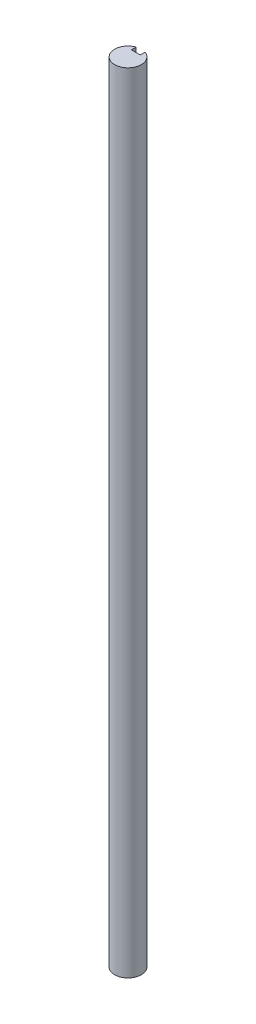
ISO-10303-21;
HEADER;
FILE_DESCRIPTION(('STEP AP214'),'2;1');
FILE_NAME('part.step','',(''),(''),'','','');
FILE_SCHEMA(('AUTOMOTIVE_DESIGN { 1 0 10303 214 1 1 1 1 }'));
ENDSEC;
DATA;
#1=APPLICATION_CONTEXT('core data for automotive mechanical design processes');
#2=APPLICATION_PROTOCOL_DEFINITION('international standard','automotive_design',2000,#1);
#3=PRODUCT_CONTEXT('',#1,'mechanical');
#4=PRODUCT('Part','Part','',(#3));
#5=PRODUCT_RELATED_PRODUCT_CATEGORY('part','',(#4));
#6=PRODUCT_DEFINITION_FORMATION('','',#4);
#7=PRODUCT_DEFINITION_CONTEXT('part definition',#1,'design');
#8=PRODUCT_DEFINITION('design','',#6,#7);
#9=PRODUCT_DEFINITION_SHAPE('','',#8);
#10=(LENGTH_UNIT() NAMED_UNIT(*) SI_UNIT(.MILLI.,.METRE.));
#11=(NAMED_UNIT(*) PLANE_ANGLE_UNIT() SI_UNIT($,.RADIAN.));
#12=(NAMED_UNIT(*) SI_UNIT($,.STERADIAN.) SOLID_ANGLE_UNIT());
#13=UNCERTAINTY_MEASURE_WITH_UNIT(LENGTH_MEASURE(1.E-05),#10,'distance_accuracy_value','');
#14=(GEOMETRIC_REPRESENTATION_CONTEXT(3) GLOBAL_UNCERTAINTY_ASSIGNED_CONTEXT((#13)) GLOBAL_UNIT_ASSIGNED_CONTEXT((#10,
#11,#12)) REPRESENTATION_CONTEXT('',''));
#15=CARTESIAN_POINT('',(0.,0.,0.));
#16=DIRECTION('',(0.,0.,1.));
#17=DIRECTION('',(1.,0.,0.));
#18=AXIS2_PLACEMENT_3D('',#15,#16,#17);
#19=CARTESIAN_POINT('',(0.,-100.,0.));
#20=DIRECTION('',(0.,1.,0.));
#21=DIRECTION('',(0.,0.,-1.));
#22=AXIS2_PLACEMENT_3D('',#19,#20,#21);
#23=PLANE('',#22);
#24=DIRECTION('',(0.,0.,-1.));
#25=VECTOR('',#24,1.);
#26=CARTESIAN_POINT('',(2.,-100.,0.));
#27=LINE('',#26,#25);
#28=CARTESIAN_POINT('',(2.,-100.,-1.));
#29=VERTEX_POINT('',#28);
#30=CARTESIAN_POINT('',(2.,-100.,-5.65685424949238));
#31=VERTEX_POINT('',#30);
#32=EDGE_CURVE('E135',#29,#31,#27,.T.);
#33=ORIENTED_EDGE('',*,*,#32,.T.);
#34=CARTESIAN_POINT('',(0.,-100.,0.));
#35=DIRECTION('',(0.,-1.,0.));
#36=DIRECTION('',(0.,0.,-1.));
#37=AXIS2_PLACEMENT_3D('',#34,#35,#36);
#38=CIRCLE('',#37,6.);
#39=CARTESIAN_POINT('',(-2.,-100.,-5.65685424949238));
#40=VERTEX_POINT('',#39);
#41=EDGE_CURVE('E182',#31,#40,#38,.T.);
#42=ORIENTED_EDGE('',*,*,#41,.T.);
#43=DIRECTION('',(0.,0.,1.));
#44=VECTOR('',#43,1.);
#45=CARTESIAN_POINT('',(-2.,-100.,0.));
#46=LINE('',#45,#44);
#47=CARTESIAN_POINT('',(-2.,-100.,-0.999999999999999));
#48=VERTEX_POINT('',#47);
#49=EDGE_CURVE('E185',#40,#48,#46,.T.);
#50=ORIENTED_EDGE('',*,*,#49,.T.);
#51=DIRECTION('',(-1.,0.,0.));
#52=VECTOR('',#51,1.);
#53=CARTESIAN_POINT('',(0.,-100.,-1.));
#54=LINE('',#53,#52);
#55=EDGE_CURVE('E130',#29,#48,#54,.T.);
#56=ORIENTED_EDGE('',*,*,#55,.F.);
#57=EDGE_LOOP('',(#33,#42,#50,#56));
#58=FACE_BOUND('',#57,.T.);
#59=ADVANCED_FACE('F37',(#58),#23,.F.);
#60=CARTESIAN_POINT('',(0.,-100.,0.));
#61=DIRECTION('',(0.,1.,0.));
#62=DIRECTION('',(0.,0.,-1.));
#63=AXIS2_PLACEMENT_3D('',#60,#61,#62);
#64=CYLINDRICAL_SURFACE('',#63,6.);
#65=CARTESIAN_POINT('',(0.,-80.,0.));
#66=DIRECTION('',(0.,-1.,0.));
#67=DIRECTION('',(0.,0.,-1.));
#68=AXIS2_PLACEMENT_3D('',#65,#66,#67);
#69=CIRCLE('',#68,6.);
#70=CARTESIAN_POINT('',(2.,-80.,-5.65685424949238));
#71=VERTEX_POINT('',#70);
#72=CARTESIAN_POINT('',(-2.,-80.,-5.65685424949238));
#73=VERTEX_POINT('',#72);
#74=EDGE_CURVE('E189',#71,#73,#69,.F.);
#75=ORIENTED_EDGE('',*,*,#74,.T.);
#76=DIRECTION('',(0.,1.,0.));
#77=VECTOR('',#76,1.);
#78=CARTESIAN_POINT('',(-2.,-100.,-5.65685424949238));
#79=LINE('',#78,#77);
#80=EDGE_CURVE('E174',#40,#73,#79,.T.);
#81=ORIENTED_EDGE('',*,*,#80,.F.);
#82=ORIENTED_EDGE('',*,*,#41,.F.);
#83=DIRECTION('',(0.,1.,0.));
#84=VECTOR('',#83,1.);
#85=CARTESIAN_POINT('',(2.,-100.,-5.65685424949238));
#86=LINE('',#85,#84);
#87=EDGE_CURVE('E177',#71,#31,#86,.F.);
#88=ORIENTED_EDGE('',*,*,#87,.F.);
#89=EDGE_LOOP('',(#75,#81,#82,#88));
#90=FACE_BOUND('',#89,.T.);
#91=CARTESIAN_POINT('',(0.,204.,0.));
#92=DIRECTION('',(0.,1.,0.));
#93=DIRECTION('',(0.,0.,1.));
#94=AXIS2_PLACEMENT_3D('',#91,#92,#93);
#95=CIRCLE('',#94,6.);
#96=CARTESIAN_POINT('',(-2.,204.,-5.65685424949238));
#97=VERTEX_POINT('',#96);
#98=CARTESIAN_POINT('',(2.,204.,-5.65685424949238));
#99=VERTEX_POINT('',#98);
#100=EDGE_CURVE('E11',#97,#99,#95,.F.);
#101=ORIENTED_EDGE('',*,*,#100,.T.);
#102=DIRECTION('',(0.,1.,0.));
#103=VECTOR('',#102,1.);
#104=CARTESIAN_POINT('',(2.,-100.,-5.65685424949238));
#105=LINE('',#104,#103);
#106=CARTESIAN_POINT('',(2.,254.,-5.65685424949238));
#107=VERTEX_POINT('',#106);
#108=EDGE_CURVE('E157',#107,#99,#105,.F.);
#109=ORIENTED_EDGE('',*,*,#108,.F.);
#110=CARTESIAN_POINT('',(0.,254.,0.));
#111=DIRECTION('',(0.,-1.,0.));
#112=DIRECTION('',(0.,0.,-1.));
#113=AXIS2_PLACEMENT_3D('',#110,#111,#112);
#114=CIRCLE('',#113,6.);
#115=CARTESIAN_POINT('',(-2.,254.,-5.65685424949238));
#116=VERTEX_POINT('',#115);
#117=EDGE_CURVE('E179',#107,#116,#114,.T.);
#118=ORIENTED_EDGE('',*,*,#117,.T.);
#119=DIRECTION('',(0.,1.,0.));
#120=VECTOR('',#119,1.);
#121=CARTESIAN_POINT('',(-2.,-100.,-5.65685424949238));
#122=LINE('',#121,#120);
#123=EDGE_CURVE('E159',#97,#116,#122,.T.);
#124=ORIENTED_EDGE('',*,*,#123,.F.);
#125=EDGE_LOOP('',(#101,#109,#118,#124));
#126=FACE_BOUND('',#125,.T.);
#127=ADVANCED_FACE('F39',(#90,#126),#64,.T.);
#128=CARTESIAN_POINT('',(0.,254.,0.));
#129=DIRECTION('',(0.,1.,0.));
#130=DIRECTION('',(0.,0.,-1.));
#131=AXIS2_PLACEMENT_3D('',#128,#129,#130);
#132=PLANE('',#131);
#133=ORIENTED_EDGE('',*,*,#117,.F.);
#134=DIRECTION('',(0.,0.,-1.));
#135=VECTOR('',#134,1.);
#136=CARTESIAN_POINT('',(2.,254.,0.));
#137=LINE('',#136,#135);
#138=CARTESIAN_POINT('',(2.,254.,-3.5));
#139=VERTEX_POINT('',#138);
#140=EDGE_CURVE('E60',#139,#107,#137,.T.);
#141=ORIENTED_EDGE('',*,*,#140,.F.);
#142=DIRECTION('',(1.,0.,0.));
#143=VECTOR('',#142,1.);
#144=CARTESIAN_POINT('',(0.,254.,-3.5));
#145=LINE('',#144,#143);
#146=CARTESIAN_POINT('',(-2.,254.,-3.5));
#147=VERTEX_POINT('',#146);
#148=EDGE_CURVE('E137',#147,#139,#145,.T.);
#149=ORIENTED_EDGE('',*,*,#148,.F.);
#150=DIRECTION('',(0.,0.,1.));
#151=VECTOR('',#150,1.);
#152=CARTESIAN_POINT('',(-2.,254.,0.));
#153=LINE('',#152,#151);
#154=EDGE_CURVE('E45',#116,#147,#153,.T.);
#155=ORIENTED_EDGE('',*,*,#154,.F.);
#156=EDGE_LOOP('',(#133,#141,#149,#155));
#157=FACE_BOUND('',#156,.T.);
#158=ADVANCED_FACE('F198',(#157),#132,.T.);
#159=CARTESIAN_POINT('',(0.,-80.,-3.5));
#160=DIRECTION('',(0.,0.,-1.));
#161=DIRECTION('',(1.,0.,0.));
#162=AXIS2_PLACEMENT_3D('',#159,#160,#161);
#163=PLANE('',#162);
#164=DIRECTION('',(-1.,0.,0.));
#165=VECTOR('',#164,1.);
#166=CARTESIAN_POINT('',(0.,-94.,-3.5));
#167=LINE('',#166,#165);
#168=CARTESIAN_POINT('',(2.,-94.,-3.5));
#169=VERTEX_POINT('',#168);
#170=CARTESIAN_POINT('',(-2.,-94.,-3.5));
#171=VERTEX_POINT('',#170);
#172=EDGE_CURVE('E129',#169,#171,#167,.T.);
#173=ORIENTED_EDGE('',*,*,#172,.T.);
#174=DIRECTION('',(0.,-1.,0.));
#175=VECTOR('',#174,1.);
#176=CARTESIAN_POINT('',(-2.,-80.,-3.5));
#177=LINE('',#176,#175);
#178=CARTESIAN_POINT('',(-2.,-80.,-3.5));
#179=VERTEX_POINT('',#178);
#180=EDGE_CURVE('E169',#179,#171,#177,.T.);
#181=ORIENTED_EDGE('',*,*,#180,.F.);
#182=DIRECTION('',(-1.,0.,0.));
#183=VECTOR('',#182,1.);
#184=CARTESIAN_POINT('',(0.,-80.,-3.5));
#185=LINE('',#184,#183);
#186=CARTESIAN_POINT('',(2.,-80.,-3.5));
#187=VERTEX_POINT('',#186);
#188=EDGE_CURVE('E164',#187,#179,#185,.T.);
#189=ORIENTED_EDGE('',*,*,#188,.F.);
#190=DIRECTION('',(0.,-1.,0.));
#191=VECTOR('',#190,1.);
#192=CARTESIAN_POINT('',(2.,-80.,-3.5));
#193=LINE('',#192,#191);
#194=EDGE_CURVE('E172',#187,#169,#193,.T.);
#195=ORIENTED_EDGE('',*,*,#194,.T.);
#196=EDGE_LOOP('',(#173,#181,#189,#195));
#197=FACE_BOUND('',#196,.T.);
#198=ADVANCED_FACE('F225',(#197),#163,.T.);
#199=CARTESIAN_POINT('',(2.,-80.,0.));
#200=DIRECTION('',(-1.,0.,0.));
#201=DIRECTION('',(0.,0.,-1.));
#202=AXIS2_PLACEMENT_3D('',#199,#200,#201);
#203=PLANE('',#202);
#204=ORIENTED_EDGE('',*,*,#194,.F.);
#205=DIRECTION('',(0.,0.,1.));
#206=VECTOR('',#205,1.);
#207=CARTESIAN_POINT('',(2.,-80.,0.));
#208=LINE('',#207,#206);
#209=EDGE_CURVE('E162',#71,#187,#208,.T.);
#210=ORIENTED_EDGE('',*,*,#209,.F.);
#211=ORIENTED_EDGE('',*,*,#87,.T.);
#212=ORIENTED_EDGE('',*,*,#32,.F.);
#213=DIRECTION('',(0.,-1.,0.));
#214=VECTOR('',#213,1.);
#215=CARTESIAN_POINT('',(2.,-94.,-1.));
#216=LINE('',#215,#214);
#217=CARTESIAN_POINT('',(2.,-94.,-1.));
#218=VERTEX_POINT('',#217);
#219=EDGE_CURVE('E119',#218,#29,#216,.T.);
#220=ORIENTED_EDGE('',*,*,#219,.F.);
#221=DIRECTION('',(0.,0.,1.));
#222=VECTOR('',#221,1.);
#223=CARTESIAN_POINT('',(2.,-94.,0.));
#224=LINE('',#223,#222);
#225=EDGE_CURVE('E52',#169,#218,#224,.T.);
#226=ORIENTED_EDGE('',*,*,#225,.F.);
#227=EDGE_LOOP('',(#204,#210,#211,#212,#220,#226));
#228=FACE_BOUND('',#227,.T.);
#229=ADVANCED_FACE('F133',(#228),#203,.T.);
#230=CARTESIAN_POINT('',(-2.,-80.,0.));
#231=DIRECTION('',(1.,0.,0.));
#232=DIRECTION('',(0.,0.,1.));
#233=AXIS2_PLACEMENT_3D('',#230,#231,#232);
#234=PLANE('',#233);
#235=DIRECTION('',(0.,0.,-1.));
#236=VECTOR('',#235,1.);
#237=CARTESIAN_POINT('',(-2.,-80.,0.));
#238=LINE('',#237,#236);
#239=EDGE_CURVE('E167',#179,#73,#238,.T.);
#240=ORIENTED_EDGE('',*,*,#239,.F.);
#241=ORIENTED_EDGE('',*,*,#180,.T.);
#242=DIRECTION('',(0.,0.,-1.));
#243=VECTOR('',#242,1.);
#244=CARTESIAN_POINT('',(-2.,-94.,0.));
#245=LINE('',#244,#243);
#246=CARTESIAN_POINT('',(-2.,-94.,-0.999999999999999));
#247=VERTEX_POINT('',#246);
#248=EDGE_CURVE('E124',#247,#171,#245,.T.);
#249=ORIENTED_EDGE('',*,*,#248,.F.);
#250=DIRECTION('',(0.,-1.,0.));
#251=VECTOR('',#250,1.);
#252=CARTESIAN_POINT('',(-2.,-94.,-0.999999999999999));
#253=LINE('',#252,#251);
#254=EDGE_CURVE('E121',#247,#48,#253,.T.);
#255=ORIENTED_EDGE('',*,*,#254,.T.);
#256=ORIENTED_EDGE('',*,*,#49,.F.);
#257=ORIENTED_EDGE('',*,*,#80,.T.);
#258=EDGE_LOOP('',(#240,#241,#249,#255,#256,#257));
#259=FACE_BOUND('',#258,.T.);
#260=ADVANCED_FACE('F228',(#259),#234,.T.);
#261=CARTESIAN_POINT('',(0.,-80.,0.));
#262=DIRECTION('',(0.,1.,0.));
#263=DIRECTION('',(0.,0.,-1.));
#264=AXIS2_PLACEMENT_3D('',#261,#262,#263);
#265=PLANE('',#264);
#266=ORIENTED_EDGE('',*,*,#74,.F.);
#267=ORIENTED_EDGE('',*,*,#209,.T.);
#268=ORIENTED_EDGE('',*,*,#188,.T.);
#269=ORIENTED_EDGE('',*,*,#239,.T.);
#270=EDGE_LOOP('',(#266,#267,#268,#269));
#271=FACE_BOUND('',#270,.T.);
#272=ADVANCED_FACE('F234',(#271),#265,.F.);
#273=CARTESIAN_POINT('',(-2.,204.,0.));
#274=DIRECTION('',(1.,0.,0.));
#275=DIRECTION('',(0.,0.,1.));
#276=AXIS2_PLACEMENT_3D('',#273,#274,#275);
#277=PLANE('',#276);
#278=DIRECTION('',(0.,0.,1.));
#279=VECTOR('',#278,1.);
#280=CARTESIAN_POINT('',(-2.,204.,0.));
#281=LINE('',#280,#279);
#282=CARTESIAN_POINT('',(-2.,204.,-3.5));
#283=VERTEX_POINT('',#282);
#284=EDGE_CURVE('E142',#97,#283,#281,.T.);
#285=ORIENTED_EDGE('',*,*,#284,.F.);
#286=ORIENTED_EDGE('',*,*,#123,.T.);
#287=ORIENTED_EDGE('',*,*,#154,.T.);
#288=DIRECTION('',(0.,1.,0.));
#289=VECTOR('',#288,1.);
#290=CARTESIAN_POINT('',(-2.,204.,-3.5));
#291=LINE('',#290,#289);
#292=EDGE_CURVE('E155',#283,#147,#291,.T.);
#293=ORIENTED_EDGE('',*,*,#292,.F.);
#294=EDGE_LOOP('',(#285,#286,#287,#293));
#295=FACE_BOUND('',#294,.T.);
#296=ADVANCED_FACE('F195',(#295),#277,.T.);
#297=CARTESIAN_POINT('',(0.,204.,-3.5));
#298=DIRECTION('',(0.,0.,-1.));
#299=DIRECTION('',(1.,0.,0.));
#300=AXIS2_PLACEMENT_3D('',#297,#298,#299);
#301=PLANE('',#300);
#302=ORIENTED_EDGE('',*,*,#148,.T.);
#303=DIRECTION('',(0.,1.,0.));
#304=VECTOR('',#303,1.);
#305=CARTESIAN_POINT('',(2.,204.,-3.5));
#306=LINE('',#305,#304);
#307=CARTESIAN_POINT('',(2.,204.,-3.5));
#308=VERTEX_POINT('',#307);
#309=EDGE_CURVE('E150',#308,#139,#306,.T.);
#310=ORIENTED_EDGE('',*,*,#309,.F.);
#311=DIRECTION('',(1.,0.,0.));
#312=VECTOR('',#311,1.);
#313=CARTESIAN_POINT('',(0.,204.,-3.5));
#314=LINE('',#313,#312);
#315=EDGE_CURVE('E145',#283,#308,#314,.T.);
#316=ORIENTED_EDGE('',*,*,#315,.F.);
#317=ORIENTED_EDGE('',*,*,#292,.T.);
#318=EDGE_LOOP('',(#302,#310,#316,#317));
#319=FACE_BOUND('',#318,.T.);
#320=ADVANCED_FACE('F201',(#319),#301,.T.);
#321=CARTESIAN_POINT('',(2.,204.,0.));
#322=DIRECTION('',(-1.,0.,0.));
#323=DIRECTION('',(0.,0.,-1.));
#324=AXIS2_PLACEMENT_3D('',#321,#322,#323);
#325=PLANE('',#324);
#326=ORIENTED_EDGE('',*,*,#140,.T.);
#327=ORIENTED_EDGE('',*,*,#108,.T.);
#328=DIRECTION('',(0.,0.,-1.));
#329=VECTOR('',#328,1.);
#330=CARTESIAN_POINT('',(2.,204.,0.));
#331=LINE('',#330,#329);
#332=EDGE_CURVE('E148',#308,#99,#331,.T.);
#333=ORIENTED_EDGE('',*,*,#332,.F.);
#334=ORIENTED_EDGE('',*,*,#309,.T.);
#335=EDGE_LOOP('',(#326,#327,#333,#334));
#336=FACE_BOUND('',#335,.T.);
#337=ADVANCED_FACE('F207',(#336),#325,.T.);
#338=CARTESIAN_POINT('',(0.,204.,0.));
#339=DIRECTION('',(0.,-1.,0.));
#340=DIRECTION('',(0.,0.,1.));
#341=AXIS2_PLACEMENT_3D('',#338,#339,#340);
#342=PLANE('',#341);
#343=ORIENTED_EDGE('',*,*,#100,.F.);
#344=ORIENTED_EDGE('',*,*,#284,.T.);
#345=ORIENTED_EDGE('',*,*,#315,.T.);
#346=ORIENTED_EDGE('',*,*,#332,.T.);
#347=EDGE_LOOP('',(#343,#344,#345,#346));
#348=FACE_BOUND('',#347,.T.);
#349=ADVANCED_FACE('F204',(#348),#342,.F.);
#350=CARTESIAN_POINT('',(0.,-94.,-1.));
#351=DIRECTION('',(0.,0.,-1.));
#352=DIRECTION('',(1.,0.,0.));
#353=AXIS2_PLACEMENT_3D('',#350,#351,#352);
#354=PLANE('',#353);
#355=ORIENTED_EDGE('',*,*,#55,.T.);
#356=ORIENTED_EDGE('',*,*,#254,.F.);
#357=DIRECTION('',(-1.,0.,0.));
#358=VECTOR('',#357,1.);
#359=CARTESIAN_POINT('',(0.,-94.,-1.));
#360=LINE('',#359,#358);
#361=EDGE_CURVE('E116',#218,#247,#360,.T.);
#362=ORIENTED_EDGE('',*,*,#361,.F.);
#363=ORIENTED_EDGE('',*,*,#219,.T.);
#364=EDGE_LOOP('',(#355,#356,#362,#363));
#365=FACE_BOUND('',#364,.T.);
#366=ADVANCED_FACE('F118',(#365),#354,.T.);
#367=CARTESIAN_POINT('',(0.,-94.,0.));
#368=DIRECTION('',(0.,1.,0.));
#369=DIRECTION('',(0.,0.,-1.));
#370=AXIS2_PLACEMENT_3D('',#367,#368,#369);
#371=PLANE('',#370);
#372=ORIENTED_EDGE('',*,*,#172,.F.);
#373=ORIENTED_EDGE('',*,*,#225,.T.);
#374=ORIENTED_EDGE('',*,*,#361,.T.);
#375=ORIENTED_EDGE('',*,*,#248,.T.);
#376=EDGE_LOOP('',(#372,#373,#374,#375));
#377=FACE_BOUND('',#376,.T.);
#378=ADVANCED_FACE('F127',(#377),#371,.F.);
#379=CLOSED_SHELL('',(#59,#127,#158,#198,#229,#260,#272,#296,#320,#337,#349,#366,#378));
#380=MANIFOLD_SOLID_BREP('B2',#379);
#381=ADVANCED_BREP_SHAPE_REPRESENTATION('',(#18,#380),#14);
#382=SHAPE_DEFINITION_REPRESENTATION(#9,#381);
ENDSEC;
END-ISO-10303-21;
